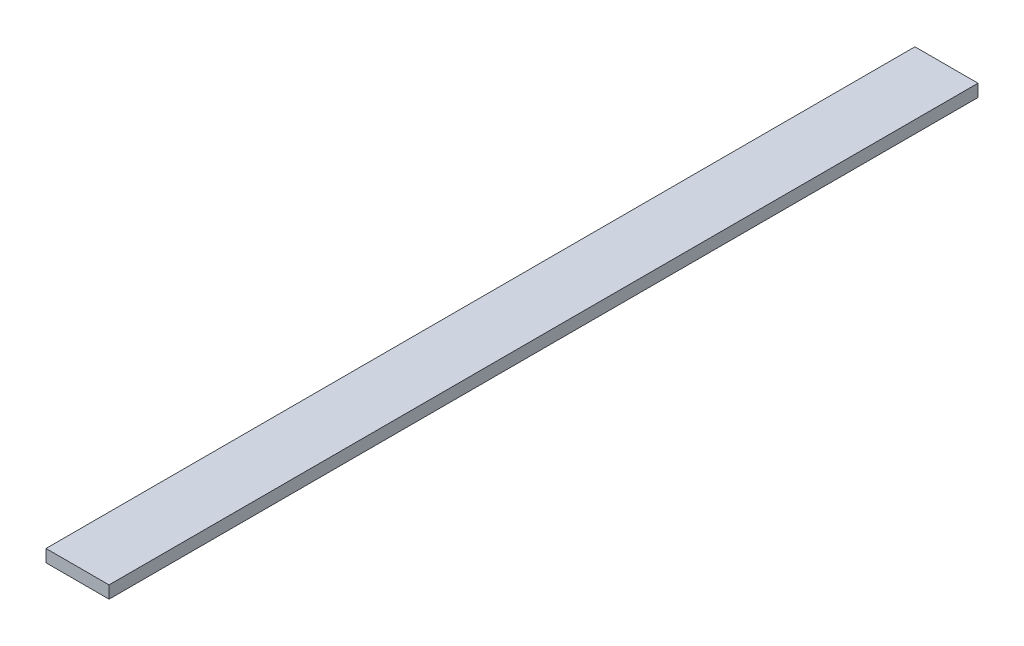
ISO-10303-21;
HEADER;
FILE_DESCRIPTION(('STEP AP214'),'2;1');
FILE_NAME('part.step','',(''),(''),'','','');
FILE_SCHEMA(('AUTOMOTIVE_DESIGN { 1 0 10303 214 1 1 1 1 }'));
ENDSEC;
DATA;
#1=APPLICATION_CONTEXT('core data for automotive mechanical design processes');
#2=APPLICATION_PROTOCOL_DEFINITION('international standard','automotive_design',2000,#1);
#3=PRODUCT_CONTEXT('',#1,'mechanical');
#4=PRODUCT('Part','Part','',(#3));
#5=PRODUCT_RELATED_PRODUCT_CATEGORY('part','',(#4));
#6=PRODUCT_DEFINITION_FORMATION('','',#4);
#7=PRODUCT_DEFINITION_CONTEXT('part definition',#1,'design');
#8=PRODUCT_DEFINITION('design','',#6,#7);
#9=PRODUCT_DEFINITION_SHAPE('','',#8);
#10=(LENGTH_UNIT() NAMED_UNIT(*) SI_UNIT(.MILLI.,.METRE.));
#11=(NAMED_UNIT(*) PLANE_ANGLE_UNIT() SI_UNIT($,.RADIAN.));
#12=(NAMED_UNIT(*) SI_UNIT($,.STERADIAN.) SOLID_ANGLE_UNIT());
#13=UNCERTAINTY_MEASURE_WITH_UNIT(LENGTH_MEASURE(1.E-05),#10,'distance_accuracy_value','');
#14=(GEOMETRIC_REPRESENTATION_CONTEXT(3) GLOBAL_UNCERTAINTY_ASSIGNED_CONTEXT((#13)) GLOBAL_UNIT_ASSIGNED_CONTEXT((#10,
#11,#12)) REPRESENTATION_CONTEXT('',''));
#15=CARTESIAN_POINT('',(0.,0.,0.));
#16=DIRECTION('',(0.,0.,1.));
#17=DIRECTION('',(1.,0.,0.));
#18=AXIS2_PLACEMENT_3D('',#15,#16,#17);
#19=CARTESIAN_POINT('',(25.4,-5.,700.));
#20=DIRECTION('',(-1.,0.,0.));
#21=DIRECTION('',(0.,0.,1.));
#22=AXIS2_PLACEMENT_3D('',#19,#20,#21);
#23=PLANE('',#22);
#24=DIRECTION('',(0.,1.,0.));
#25=VECTOR('',#24,1.);
#26=CARTESIAN_POINT('',(25.4,-5.,0.));
#27=LINE('',#26,#25);
#28=CARTESIAN_POINT('',(25.4,-5.,0.));
#29=VERTEX_POINT('',#28);
#30=CARTESIAN_POINT('',(25.4,5.,0.));
#31=VERTEX_POINT('',#30);
#32=EDGE_CURVE('E100',#29,#31,#27,.T.);
#33=ORIENTED_EDGE('',*,*,#32,.T.);
#34=DIRECTION('',(0.,0.,-1.));
#35=VECTOR('',#34,1.);
#36=CARTESIAN_POINT('',(25.4,5.,700.));
#37=LINE('',#36,#35);
#38=CARTESIAN_POINT('',(25.4,5.,700.));
#39=VERTEX_POINT('',#38);
#40=EDGE_CURVE('E11',#39,#31,#37,.T.);
#41=ORIENTED_EDGE('',*,*,#40,.F.);
#42=DIRECTION('',(0.,1.,0.));
#43=VECTOR('',#42,1.);
#44=CARTESIAN_POINT('',(25.4,-5.,700.));
#45=LINE('',#44,#43);
#46=CARTESIAN_POINT('',(25.4,-5.,700.));
#47=VERTEX_POINT('',#46);
#48=EDGE_CURVE('E88',#47,#39,#45,.T.);
#49=ORIENTED_EDGE('',*,*,#48,.F.);
#50=DIRECTION('',(0.,0.,-1.));
#51=VECTOR('',#50,1.);
#52=CARTESIAN_POINT('',(25.4,-5.,700.));
#53=LINE('',#52,#51);
#54=EDGE_CURVE('E96',#47,#29,#53,.T.);
#55=ORIENTED_EDGE('',*,*,#54,.T.);
#56=EDGE_LOOP('',(#33,#41,#49,#55));
#57=FACE_BOUND('',#56,.T.);
#58=ADVANCED_FACE('F37',(#57),#23,.F.);
#59=CARTESIAN_POINT('',(-25.4,5.,700.));
#60=DIRECTION('',(0.,-1.,0.));
#61=DIRECTION('',(0.,0.,-1.));
#62=AXIS2_PLACEMENT_3D('',#59,#60,#61);
#63=PLANE('',#62);
#64=DIRECTION('',(-1.,0.,0.));
#65=VECTOR('',#64,1.);
#66=CARTESIAN_POINT('',(-25.4,5.,0.));
#67=LINE('',#66,#65);
#68=CARTESIAN_POINT('',(-25.4,5.,0.));
#69=VERTEX_POINT('',#68);
#70=EDGE_CURVE('E92',#31,#69,#67,.T.);
#71=ORIENTED_EDGE('',*,*,#70,.T.);
#72=DIRECTION('',(0.,0.,-1.));
#73=VECTOR('',#72,1.);
#74=CARTESIAN_POINT('',(-25.4,5.,700.));
#75=LINE('',#74,#73);
#76=CARTESIAN_POINT('',(-25.4,5.,700.));
#77=VERTEX_POINT('',#76);
#78=EDGE_CURVE('E45',#77,#69,#75,.T.);
#79=ORIENTED_EDGE('',*,*,#78,.F.);
#80=DIRECTION('',(-1.,0.,0.));
#81=VECTOR('',#80,1.);
#82=CARTESIAN_POINT('',(-25.4,5.,700.));
#83=LINE('',#82,#81);
#84=EDGE_CURVE('E83',#39,#77,#83,.T.);
#85=ORIENTED_EDGE('',*,*,#84,.F.);
#86=ORIENTED_EDGE('',*,*,#40,.T.);
#87=EDGE_LOOP('',(#71,#79,#85,#86));
#88=FACE_BOUND('',#87,.T.);
#89=ADVANCED_FACE('F91',(#88),#63,.F.);
#90=CARTESIAN_POINT('',(-25.4,-5.,700.));
#91=DIRECTION('',(1.,0.,0.));
#92=DIRECTION('',(0.,0.,-1.));
#93=AXIS2_PLACEMENT_3D('',#90,#91,#92);
#94=PLANE('',#93);
#95=DIRECTION('',(0.,-1.,0.));
#96=VECTOR('',#95,1.);
#97=CARTESIAN_POINT('',(-25.4,-5.,0.));
#98=LINE('',#97,#96);
#99=CARTESIAN_POINT('',(-25.4,-5.,0.));
#100=VERTEX_POINT('',#99);
#101=EDGE_CURVE('E70',#69,#100,#98,.T.);
#102=ORIENTED_EDGE('',*,*,#101,.T.);
#103=DIRECTION('',(0.,0.,-1.));
#104=VECTOR('',#103,1.);
#105=CARTESIAN_POINT('',(-25.4,-5.,700.));
#106=LINE('',#105,#104);
#107=CARTESIAN_POINT('',(-25.4,-5.,700.));
#108=VERTEX_POINT('',#107);
#109=EDGE_CURVE('E93',#108,#100,#106,.T.);
#110=ORIENTED_EDGE('',*,*,#109,.F.);
#111=DIRECTION('',(0.,-1.,0.));
#112=VECTOR('',#111,1.);
#113=CARTESIAN_POINT('',(-25.4,-5.,700.));
#114=LINE('',#113,#112);
#115=EDGE_CURVE('E86',#77,#108,#114,.T.);
#116=ORIENTED_EDGE('',*,*,#115,.F.);
#117=ORIENTED_EDGE('',*,*,#78,.T.);
#118=EDGE_LOOP('',(#102,#110,#116,#117));
#119=FACE_BOUND('',#118,.T.);
#120=ADVANCED_FACE('F94',(#119),#94,.F.);
#121=CARTESIAN_POINT('',(-25.4,-5.,700.));
#122=DIRECTION('',(0.,1.,0.));
#123=DIRECTION('',(0.,0.,1.));
#124=AXIS2_PLACEMENT_3D('',#121,#122,#123);
#125=PLANE('',#124);
#126=DIRECTION('',(1.,0.,0.));
#127=VECTOR('',#126,1.);
#128=CARTESIAN_POINT('',(-25.4,-5.,0.));
#129=LINE('',#128,#127);
#130=EDGE_CURVE('E76',#100,#29,#129,.T.);
#131=ORIENTED_EDGE('',*,*,#130,.T.);
#132=ORIENTED_EDGE('',*,*,#54,.F.);
#133=DIRECTION('',(1.,0.,0.));
#134=VECTOR('',#133,1.);
#135=CARTESIAN_POINT('',(-25.4,-5.,700.));
#136=LINE('',#135,#134);
#137=EDGE_CURVE('E53',#108,#47,#136,.T.);
#138=ORIENTED_EDGE('',*,*,#137,.F.);
#139=ORIENTED_EDGE('',*,*,#109,.T.);
#140=EDGE_LOOP('',(#131,#132,#138,#139));
#141=FACE_BOUND('',#140,.T.);
#142=ADVANCED_FACE('F107',(#141),#125,.F.);
#143=CARTESIAN_POINT('',(0.,0.,700.));
#144=DIRECTION('',(0.,0.,-1.));
#145=DIRECTION('',(-1.,0.,0.));
#146=AXIS2_PLACEMENT_3D('',#143,#144,#145);
#147=PLANE('',#146);
#148=ORIENTED_EDGE('',*,*,#48,.T.);
#149=ORIENTED_EDGE('',*,*,#84,.T.);
#150=ORIENTED_EDGE('',*,*,#115,.T.);
#151=ORIENTED_EDGE('',*,*,#137,.T.);
#152=EDGE_LOOP('',(#148,#149,#150,#151));
#153=FACE_BOUND('',#152,.T.);
#154=ADVANCED_FACE('F84',(#153),#147,.F.);
#155=CARTESIAN_POINT('',(0.,0.,0.));
#156=DIRECTION('',(0.,0.,-1.));
#157=DIRECTION('',(-1.,0.,0.));
#158=AXIS2_PLACEMENT_3D('',#155,#156,#157);
#159=PLANE('',#158);
#160=ORIENTED_EDGE('',*,*,#32,.F.);
#161=ORIENTED_EDGE('',*,*,#130,.F.);
#162=ORIENTED_EDGE('',*,*,#101,.F.);
#163=ORIENTED_EDGE('',*,*,#70,.F.);
#164=EDGE_LOOP('',(#160,#161,#162,#163));
#165=FACE_BOUND('',#164,.T.);
#166=ADVANCED_FACE('F110',(#165),#159,.T.);
#167=CLOSED_SHELL('',(#58,#89,#120,#142,#154,#166));
#168=MANIFOLD_SOLID_BREP('B2',#167);
#169=ADVANCED_BREP_SHAPE_REPRESENTATION('',(#18,#168),#14);
#170=SHAPE_DEFINITION_REPRESENTATION(#9,#169);
ENDSEC;
END-ISO-10303-21;
